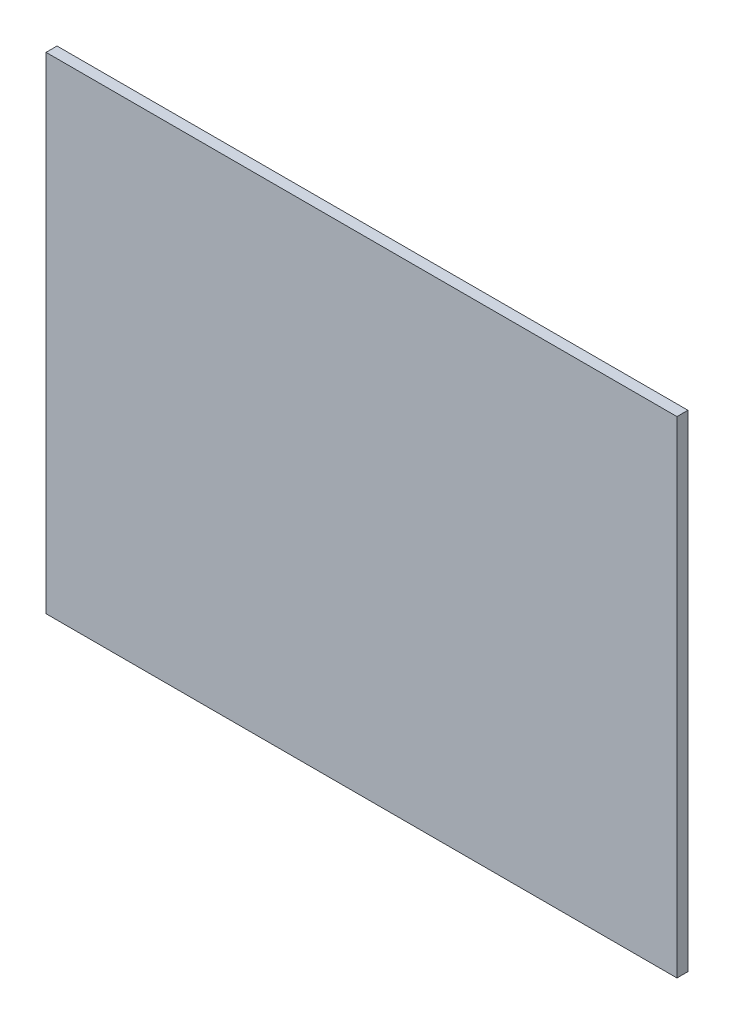
ISO-10303-21;
HEADER;
FILE_DESCRIPTION(('STEP AP214'),'2;1');
FILE_NAME('part.step','',(''),(''),'','','');
FILE_SCHEMA(('AUTOMOTIVE_DESIGN { 1 0 10303 214 1 1 1 1 }'));
ENDSEC;
DATA;
#1=APPLICATION_CONTEXT('core data for automotive mechanical design processes');
#2=APPLICATION_PROTOCOL_DEFINITION('international standard','automotive_design',2000,#1);
#3=PRODUCT_CONTEXT('',#1,'mechanical');
#4=PRODUCT('Part','Part','',(#3));
#5=PRODUCT_RELATED_PRODUCT_CATEGORY('part','',(#4));
#6=PRODUCT_DEFINITION_FORMATION('','',#4);
#7=PRODUCT_DEFINITION_CONTEXT('part definition',#1,'design');
#8=PRODUCT_DEFINITION('design','',#6,#7);
#9=PRODUCT_DEFINITION_SHAPE('','',#8);
#10=(LENGTH_UNIT() NAMED_UNIT(*) SI_UNIT(.MILLI.,.METRE.));
#11=(NAMED_UNIT(*) PLANE_ANGLE_UNIT() SI_UNIT($,.RADIAN.));
#12=(NAMED_UNIT(*) SI_UNIT($,.STERADIAN.) SOLID_ANGLE_UNIT());
#13=UNCERTAINTY_MEASURE_WITH_UNIT(LENGTH_MEASURE(1.E-05),#10,'distance_accuracy_value','');
#14=(GEOMETRIC_REPRESENTATION_CONTEXT(3) GLOBAL_UNCERTAINTY_ASSIGNED_CONTEXT((#13)) GLOBAL_UNIT_ASSIGNED_CONTEXT((#10,
#11,#12)) REPRESENTATION_CONTEXT('',''));
#15=CARTESIAN_POINT('',(0.,0.,0.));
#16=DIRECTION('',(0.,0.,1.));
#17=DIRECTION('',(1.,0.,0.));
#18=AXIS2_PLACEMENT_3D('',#15,#16,#17);
#19=CARTESIAN_POINT('',(-49.2269219977953,40.1499703515448,-1.89738));
#20=DIRECTION('',(-1.,0.,0.));
#21=DIRECTION('',(0.,-1.,0.));
#22=AXIS2_PLACEMENT_3D('',#19,#20,#21);
#23=PLANE('',#22);
#24=DIRECTION('',(0.,-1.,0.));
#25=VECTOR('',#24,1.);
#26=CARTESIAN_POINT('',(-49.2269219977953,40.1499703515448,0.));
#27=LINE('',#26,#25);
#28=CARTESIAN_POINT('',(-49.2269219977953,40.1499703515448,0.));
#29=VERTEX_POINT('',#28);
#30=CARTESIAN_POINT('',(-49.2269219977953,-43.8500296484552,0.));
#31=VERTEX_POINT('',#30);
#32=EDGE_CURVE('E99',#29,#31,#27,.T.);
#33=ORIENTED_EDGE('',*,*,#32,.F.);
#34=DIRECTION('',(0.,0.,1.));
#35=VECTOR('',#34,1.);
#36=CARTESIAN_POINT('',(-49.2269219977953,40.1499703515448,-1.89738));
#37=LINE('',#36,#35);
#38=CARTESIAN_POINT('',(-49.2269219977953,40.1499703515448,-1.89738));
#39=VERTEX_POINT('',#38);
#40=EDGE_CURVE('E11',#39,#29,#37,.T.);
#41=ORIENTED_EDGE('',*,*,#40,.F.);
#42=DIRECTION('',(0.,-1.,0.));
#43=VECTOR('',#42,1.);
#44=CARTESIAN_POINT('',(-49.2269219977953,40.1499703515448,-1.89738));
#45=LINE('',#44,#43);
#46=CARTESIAN_POINT('',(-49.2269219977953,-43.8500296484552,-1.89738));
#47=VERTEX_POINT('',#46);
#48=EDGE_CURVE('E93',#39,#47,#45,.T.);
#49=ORIENTED_EDGE('',*,*,#48,.T.);
#50=DIRECTION('',(0.,0.,1.));
#51=VECTOR('',#50,1.);
#52=CARTESIAN_POINT('',(-49.2269219977953,-43.8500296484552,-1.89738));
#53=LINE('',#52,#51);
#54=EDGE_CURVE('E38',#47,#31,#53,.T.);
#55=ORIENTED_EDGE('',*,*,#54,.T.);
#56=EDGE_LOOP('',(#33,#41,#49,#55));
#57=FACE_BOUND('',#56,.T.);
#58=ADVANCED_FACE('F35',(#57),#23,.T.);
#59=CARTESIAN_POINT('',(-49.2269219977953,40.1499703515448,-1.89738));
#60=DIRECTION('',(0.,1.,0.));
#61=DIRECTION('',(0.,0.,1.));
#62=AXIS2_PLACEMENT_3D('',#59,#60,#61);
#63=PLANE('',#62);
#64=DIRECTION('',(-1.,0.,0.));
#65=VECTOR('',#64,1.);
#66=CARTESIAN_POINT('',(-49.2269219977953,40.1499703515448,0.));
#67=LINE('',#66,#65);
#68=CARTESIAN_POINT('',(59.7730780022047,40.1499703515448,0.));
#69=VERTEX_POINT('',#68);
#70=EDGE_CURVE('E95',#69,#29,#67,.T.);
#71=ORIENTED_EDGE('',*,*,#70,.F.);
#72=DIRECTION('',(0.,0.,1.));
#73=VECTOR('',#72,1.);
#74=CARTESIAN_POINT('',(59.7730780022047,40.1499703515448,-1.89738));
#75=LINE('',#74,#73);
#76=CARTESIAN_POINT('',(59.7730780022047,40.1499703515448,-1.89738));
#77=VERTEX_POINT('',#76);
#78=EDGE_CURVE('E44',#77,#69,#75,.T.);
#79=ORIENTED_EDGE('',*,*,#78,.F.);
#80=DIRECTION('',(-1.,0.,0.));
#81=VECTOR('',#80,1.);
#82=CARTESIAN_POINT('',(-49.2269219977953,40.1499703515448,-1.89738));
#83=LINE('',#82,#81);
#84=EDGE_CURVE('E90',#77,#39,#83,.T.);
#85=ORIENTED_EDGE('',*,*,#84,.T.);
#86=ORIENTED_EDGE('',*,*,#40,.T.);
#87=EDGE_LOOP('',(#71,#79,#85,#86));
#88=FACE_BOUND('',#87,.T.);
#89=ADVANCED_FACE('F109',(#88),#63,.T.);
#90=CARTESIAN_POINT('',(59.7730780022047,40.1499703515448,-1.89738));
#91=DIRECTION('',(1.,0.,0.));
#92=DIRECTION('',(0.,1.,0.));
#93=AXIS2_PLACEMENT_3D('',#90,#91,#92);
#94=PLANE('',#93);
#95=DIRECTION('',(0.,1.,0.));
#96=VECTOR('',#95,1.);
#97=CARTESIAN_POINT('',(59.7730780022047,40.1499703515448,0.));
#98=LINE('',#97,#96);
#99=CARTESIAN_POINT('',(59.7730780022047,-43.8500296484552,0.));
#100=VERTEX_POINT('',#99);
#101=EDGE_CURVE('E85',#100,#69,#98,.T.);
#102=ORIENTED_EDGE('',*,*,#101,.F.);
#103=DIRECTION('',(0.,0.,1.));
#104=VECTOR('',#103,1.);
#105=CARTESIAN_POINT('',(59.7730780022047,-43.8500296484552,-1.89738));
#106=LINE('',#105,#104);
#107=CARTESIAN_POINT('',(59.7730780022047,-43.8500296484552,-1.89738));
#108=VERTEX_POINT('',#107);
#109=EDGE_CURVE('E80',#108,#100,#106,.T.);
#110=ORIENTED_EDGE('',*,*,#109,.F.);
#111=DIRECTION('',(0.,1.,0.));
#112=VECTOR('',#111,1.);
#113=CARTESIAN_POINT('',(59.7730780022047,40.1499703515448,-1.89738));
#114=LINE('',#113,#112);
#115=EDGE_CURVE('E83',#108,#77,#114,.T.);
#116=ORIENTED_EDGE('',*,*,#115,.T.);
#117=ORIENTED_EDGE('',*,*,#78,.T.);
#118=EDGE_LOOP('',(#102,#110,#116,#117));
#119=FACE_BOUND('',#118,.T.);
#120=ADVANCED_FACE('F82',(#119),#94,.T.);
#121=CARTESIAN_POINT('',(-49.2269219977953,-43.8500296484552,-1.89738));
#122=DIRECTION('',(0.,-1.,0.));
#123=DIRECTION('',(0.,0.,-1.));
#124=AXIS2_PLACEMENT_3D('',#121,#122,#123);
#125=PLANE('',#124);
#126=DIRECTION('',(1.,0.,0.));
#127=VECTOR('',#126,1.);
#128=CARTESIAN_POINT('',(-49.2269219977953,-43.8500296484552,0.));
#129=LINE('',#128,#127);
#130=EDGE_CURVE('E102',#31,#100,#129,.T.);
#131=ORIENTED_EDGE('',*,*,#130,.F.);
#132=ORIENTED_EDGE('',*,*,#54,.F.);
#133=DIRECTION('',(1.,0.,0.));
#134=VECTOR('',#133,1.);
#135=CARTESIAN_POINT('',(-49.2269219977953,-43.8500296484552,-1.89738));
#136=LINE('',#135,#134);
#137=EDGE_CURVE('E89',#47,#108,#136,.T.);
#138=ORIENTED_EDGE('',*,*,#137,.T.);
#139=ORIENTED_EDGE('',*,*,#109,.T.);
#140=EDGE_LOOP('',(#131,#132,#138,#139));
#141=FACE_BOUND('',#140,.T.);
#142=ADVANCED_FACE('F92',(#141),#125,.T.);
#143=CARTESIAN_POINT('',(0.,0.,-1.89738));
#144=DIRECTION('',(0.,0.,1.));
#145=DIRECTION('',(1.,0.,0.));
#146=AXIS2_PLACEMENT_3D('',#143,#144,#145);
#147=PLANE('',#146);
#148=ORIENTED_EDGE('',*,*,#48,.F.);
#149=ORIENTED_EDGE('',*,*,#84,.F.);
#150=ORIENTED_EDGE('',*,*,#115,.F.);
#151=ORIENTED_EDGE('',*,*,#137,.F.);
#152=EDGE_LOOP('',(#148,#149,#150,#151));
#153=FACE_BOUND('',#152,.T.);
#154=ADVANCED_FACE('F88',(#153),#147,.F.);
#155=CARTESIAN_POINT('',(0.,0.,0.));
#156=DIRECTION('',(0.,0.,1.));
#157=DIRECTION('',(1.,0.,0.));
#158=AXIS2_PLACEMENT_3D('',#155,#156,#157);
#159=PLANE('',#158);
#160=ORIENTED_EDGE('',*,*,#32,.T.);
#161=ORIENTED_EDGE('',*,*,#130,.T.);
#162=ORIENTED_EDGE('',*,*,#101,.T.);
#163=ORIENTED_EDGE('',*,*,#70,.T.);
#164=EDGE_LOOP('',(#160,#161,#162,#163));
#165=FACE_BOUND('',#164,.T.);
#166=ADVANCED_FACE('F108',(#165),#159,.T.);
#167=CLOSED_SHELL('',(#58,#89,#120,#142,#154,#166));
#168=MANIFOLD_SOLID_BREP('B2',#167);
#169=ADVANCED_BREP_SHAPE_REPRESENTATION('',(#18,#168),#14);
#170=SHAPE_DEFINITION_REPRESENTATION(#9,#169);
ENDSEC;
END-ISO-10303-21;
